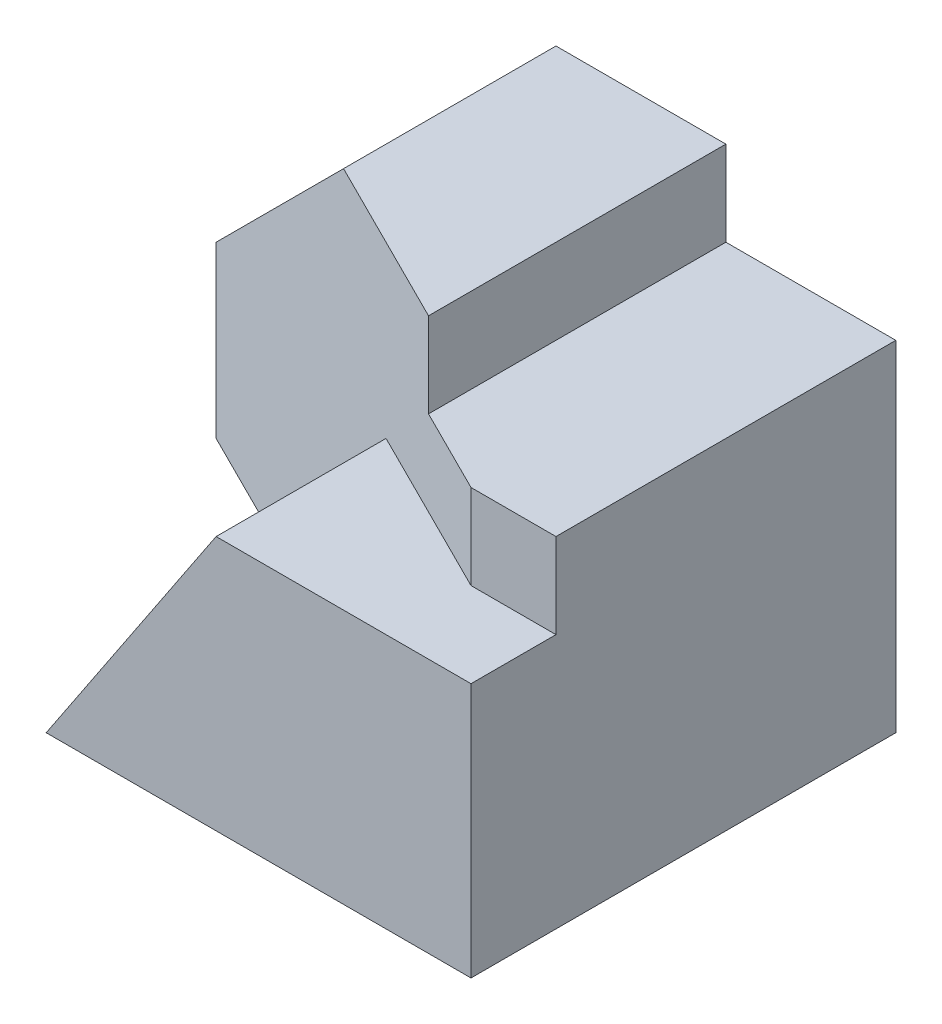
ISO-10303-21;
HEADER;
FILE_DESCRIPTION(('STEP AP214'),'2;1');
FILE_NAME('part.step','',(''),(''),'','','');
FILE_SCHEMA(('AUTOMOTIVE_DESIGN { 1 0 10303 214 1 1 1 1 }'));
ENDSEC;
DATA;
#1=APPLICATION_CONTEXT('core data for automotive mechanical design processes');
#2=APPLICATION_PROTOCOL_DEFINITION('international standard','automotive_design',2000,#1);
#3=PRODUCT_CONTEXT('',#1,'mechanical');
#4=PRODUCT('Part','Part','',(#3));
#5=PRODUCT_RELATED_PRODUCT_CATEGORY('part','',(#4));
#6=PRODUCT_DEFINITION_FORMATION('','',#4);
#7=PRODUCT_DEFINITION_CONTEXT('part definition',#1,'design');
#8=PRODUCT_DEFINITION('design','',#6,#7);
#9=PRODUCT_DEFINITION_SHAPE('','',#8);
#10=(LENGTH_UNIT() NAMED_UNIT(*) SI_UNIT(.MILLI.,.METRE.));
#11=(NAMED_UNIT(*) PLANE_ANGLE_UNIT() SI_UNIT($,.RADIAN.));
#12=(NAMED_UNIT(*) SI_UNIT($,.STERADIAN.) SOLID_ANGLE_UNIT());
#13=UNCERTAINTY_MEASURE_WITH_UNIT(LENGTH_MEASURE(1.E-05),#10,'distance_accuracy_value','');
#14=(GEOMETRIC_REPRESENTATION_CONTEXT(3) GLOBAL_UNCERTAINTY_ASSIGNED_CONTEXT((#13)) GLOBAL_UNIT_ASSIGNED_CONTEXT((#10,
#11,#12)) REPRESENTATION_CONTEXT('',''));
#15=CARTESIAN_POINT('',(0.,0.,0.));
#16=DIRECTION('',(0.,0.,1.));
#17=DIRECTION('',(1.,0.,0.));
#18=AXIS2_PLACEMENT_3D('',#15,#16,#17);
#19=CARTESIAN_POINT('',(0.,50.,50.));
#20=DIRECTION('',(0.,-1.,0.));
#21=DIRECTION('',(0.,0.,-1.));
#22=AXIS2_PLACEMENT_3D('',#19,#20,#21);
#23=PLANE('',#22);
#24=DIRECTION('',(0.,0.,1.));
#25=VECTOR('',#24,1.);
#26=CARTESIAN_POINT('',(30.,50.,0.));
#27=LINE('',#26,#25);
#28=CARTESIAN_POINT('',(30.,50.,0.));
#29=VERTEX_POINT('',#28);
#30=CARTESIAN_POINT('',(30.,50.,25.));
#31=VERTEX_POINT('',#30);
#32=EDGE_CURVE('E57',#29,#31,#27,.T.);
#33=ORIENTED_EDGE('',*,*,#32,.T.);
#34=DIRECTION('',(0.894427190999916,0.,0.447213595499958));
#35=VECTOR('',#34,1.);
#36=CARTESIAN_POINT('',(-4.,50.,8.00000000000001));
#37=LINE('',#36,#35);
#38=CARTESIAN_POINT('',(50.,50.,35.));
#39=VERTEX_POINT('',#38);
#40=EDGE_CURVE('E125',#31,#39,#37,.T.);
#41=ORIENTED_EDGE('',*,*,#40,.T.);
#42=DIRECTION('',(0.,0.,1.));
#43=VECTOR('',#42,1.);
#44=CARTESIAN_POINT('',(50.,50.,0.));
#45=LINE('',#44,#43);
#46=CARTESIAN_POINT('',(50.,50.,0.));
#47=VERTEX_POINT('',#46);
#48=EDGE_CURVE('E155',#47,#39,#45,.T.);
#49=ORIENTED_EDGE('',*,*,#48,.F.);
#50=DIRECTION('',(-1.,0.,0.));
#51=VECTOR('',#50,1.);
#52=CARTESIAN_POINT('',(0.,50.,0.));
#53=LINE('',#52,#51);
#54=EDGE_CURVE('E165',#47,#29,#53,.T.);
#55=ORIENTED_EDGE('',*,*,#54,.T.);
#56=EDGE_LOOP('',(#33,#41,#49,#55));
#57=FACE_BOUND('',#56,.T.);
#58=ADVANCED_FACE('F35',(#57),#23,.F.);
#59=CARTESIAN_POINT('',(50.,50.,0.));
#60=DIRECTION('',(-1.,0.,0.));
#61=DIRECTION('',(0.,-1.,0.));
#62=AXIS2_PLACEMENT_3D('',#59,#60,#61);
#63=PLANE('',#62);
#64=ORIENTED_EDGE('',*,*,#48,.T.);
#65=DIRECTION('',(0.,-1.,0.));
#66=VECTOR('',#65,1.);
#67=CARTESIAN_POINT('',(50.,50.,35.));
#68=LINE('',#67,#66);
#69=CARTESIAN_POINT('',(50.,40.,35.));
#70=VERTEX_POINT('',#69);
#71=EDGE_CURVE('E211',#39,#70,#68,.T.);
#72=ORIENTED_EDGE('',*,*,#71,.T.);
#73=DIRECTION('',(0.,0.,1.));
#74=VECTOR('',#73,1.);
#75=CARTESIAN_POINT('',(50.,40.,0.));
#76=LINE('',#75,#74);
#77=CARTESIAN_POINT('',(50.,40.,0.));
#78=VERTEX_POINT('',#77);
#79=EDGE_CURVE('E160',#78,#70,#76,.T.);
#80=ORIENTED_EDGE('',*,*,#79,.F.);
#81=DIRECTION('',(0.,-1.,0.));
#82=VECTOR('',#81,1.);
#83=CARTESIAN_POINT('',(50.,50.,0.));
#84=LINE('',#83,#82);
#85=EDGE_CURVE('E147',#47,#78,#84,.T.);
#86=ORIENTED_EDGE('',*,*,#85,.F.);
#87=EDGE_LOOP('',(#64,#72,#80,#86));
#88=FACE_BOUND('',#87,.T.);
#89=ADVANCED_FACE('F230',(#88),#63,.F.);
#90=CARTESIAN_POINT('',(0.,20.,0.));
#91=DIRECTION('',(0.707106781186547,-0.707106781186547,0.));
#92=DIRECTION('',(0.707106781186548,0.707106781186548,0.));
#93=AXIS2_PLACEMENT_3D('',#90,#91,#92);
#94=PLANE('',#93);
#95=DIRECTION('',(0.666666666666667,0.666666666666667,0.333333333333333));
#96=VECTOR('',#95,1.);
#97=CARTESIAN_POINT('',(-2.22222222222222,17.7777777777778,8.88888888888889));
#98=LINE('',#97,#96);
#99=CARTESIAN_POINT('',(0.,20.,10.));
#100=VERTEX_POINT('',#99);
#101=EDGE_CURVE('E11',#100,#31,#98,.T.);
#102=ORIENTED_EDGE('',*,*,#101,.T.);
#103=ORIENTED_EDGE('',*,*,#32,.F.);
#104=DIRECTION('',(0.707106781186547,0.707106781186547,0.));
#105=VECTOR('',#104,1.);
#106=CARTESIAN_POINT('',(0.,20.,0.));
#107=LINE('',#106,#105);
#108=CARTESIAN_POINT('',(0.,20.,0.));
#109=VERTEX_POINT('',#108);
#110=EDGE_CURVE('E140',#109,#29,#107,.T.);
#111=ORIENTED_EDGE('',*,*,#110,.F.);
#112=DIRECTION('',(0.,0.,1.));
#113=VECTOR('',#112,1.);
#114=CARTESIAN_POINT('',(0.,20.,0.));
#115=LINE('',#114,#113);
#116=EDGE_CURVE('E145',#109,#100,#115,.T.);
#117=ORIENTED_EDGE('',*,*,#116,.T.);
#118=EDGE_LOOP('',(#102,#103,#111,#117));
#119=FACE_BOUND('',#118,.T.);
#120=ADVANCED_FACE('F235',(#119),#94,.F.);
#121=CARTESIAN_POINT('',(0.,0.,50.));
#122=DIRECTION('',(1.,0.,0.));
#123=DIRECTION('',(0.,0.,-1.));
#124=AXIS2_PLACEMENT_3D('',#121,#122,#123);
#125=PLANE('',#124);
#126=DIRECTION('',(0.,0.,-1.));
#127=VECTOR('',#126,1.);
#128=CARTESIAN_POINT('',(0.,0.,50.));
#129=LINE('',#128,#127);
#130=CARTESIAN_POINT('',(0.,0.,10.));
#131=VERTEX_POINT('',#130);
#132=CARTESIAN_POINT('',(0.,0.,0.));
#133=VERTEX_POINT('',#132);
#134=EDGE_CURVE('E43',#131,#133,#129,.T.);
#135=ORIENTED_EDGE('',*,*,#134,.F.);
#136=DIRECTION('',(0.,-1.,0.));
#137=VECTOR('',#136,1.);
#138=CARTESIAN_POINT('',(0.,50.,10.));
#139=LINE('',#138,#137);
#140=EDGE_CURVE('E131',#100,#131,#139,.T.);
#141=ORIENTED_EDGE('',*,*,#140,.F.);
#142=ORIENTED_EDGE('',*,*,#116,.F.);
#143=DIRECTION('',(0.,-1.,0.));
#144=VECTOR('',#143,1.);
#145=CARTESIAN_POINT('',(0.,0.,0.));
#146=LINE('',#145,#144);
#147=EDGE_CURVE('E159',#109,#133,#146,.T.);
#148=ORIENTED_EDGE('',*,*,#147,.T.);
#149=EDGE_LOOP('',(#135,#141,#142,#148));
#150=FACE_BOUND('',#149,.T.);
#151=ADVANCED_FACE('F37',(#150),#125,.F.);
#152=CARTESIAN_POINT('',(0.,0.,50.));
#153=DIRECTION('',(0.,1.,0.));
#154=DIRECTION('',(0.,0.,1.));
#155=AXIS2_PLACEMENT_3D('',#152,#153,#154);
#156=PLANE('',#155);
#157=DIRECTION('',(0.,0.,1.));
#158=VECTOR('',#157,1.);
#159=CARTESIAN_POINT('',(20.,0.,20.));
#160=LINE('',#159,#158);
#161=CARTESIAN_POINT('',(20.,0.,20.));
#162=VERTEX_POINT('',#161);
#163=CARTESIAN_POINT('',(20.,0.,50.));
#164=VERTEX_POINT('',#163);
#165=EDGE_CURVE('E122',#162,#164,#160,.T.);
#166=ORIENTED_EDGE('',*,*,#165,.F.);
#167=DIRECTION('',(0.894427190999916,0.,0.447213595499958));
#168=VECTOR('',#167,1.);
#169=CARTESIAN_POINT('',(0.,0.,10.));
#170=LINE('',#169,#168);
#171=EDGE_CURVE('E128',#131,#162,#170,.T.);
#172=ORIENTED_EDGE('',*,*,#171,.F.);
#173=ORIENTED_EDGE('',*,*,#134,.T.);
#174=DIRECTION('',(1.,0.,0.));
#175=VECTOR('',#174,1.);
#176=CARTESIAN_POINT('',(0.,0.,0.));
#177=LINE('',#176,#175);
#178=CARTESIAN_POINT('',(70.,0.,0.));
#179=VERTEX_POINT('',#178);
#180=EDGE_CURVE('E171',#133,#179,#177,.T.);
#181=ORIENTED_EDGE('',*,*,#180,.T.);
#182=DIRECTION('',(0.,0.,-1.));
#183=VECTOR('',#182,1.);
#184=CARTESIAN_POINT('',(70.,0.,50.));
#185=LINE('',#184,#183);
#186=CARTESIAN_POINT('',(70.,0.,50.));
#187=VERTEX_POINT('',#186);
#188=EDGE_CURVE('E168',#187,#179,#185,.T.);
#189=ORIENTED_EDGE('',*,*,#188,.F.);
#190=DIRECTION('',(1.,0.,0.));
#191=VECTOR('',#190,1.);
#192=CARTESIAN_POINT('',(0.,0.,50.));
#193=LINE('',#192,#191);
#194=EDGE_CURVE('E138',#164,#187,#193,.T.);
#195=ORIENTED_EDGE('',*,*,#194,.F.);
#196=EDGE_LOOP('',(#166,#172,#173,#181,#189,#195));
#197=FACE_BOUND('',#196,.T.);
#198=ADVANCED_FACE('F136',(#197),#156,.F.);
#199=CARTESIAN_POINT('',(70.,0.,50.));
#200=DIRECTION('',(-1.,0.,0.));
#201=DIRECTION('',(0.,0.,1.));
#202=AXIS2_PLACEMENT_3D('',#199,#200,#201);
#203=PLANE('',#202);
#204=DIRECTION('',(0.,1.,0.));
#205=VECTOR('',#204,1.);
#206=CARTESIAN_POINT('',(70.,30.,40.));
#207=LINE('',#206,#205);
#208=CARTESIAN_POINT('',(70.,30.,40.));
#209=VERTEX_POINT('',#208);
#210=CARTESIAN_POINT('',(70.,40.,40.));
#211=VERTEX_POINT('',#210);
#212=EDGE_CURVE('E217',#209,#211,#207,.T.);
#213=ORIENTED_EDGE('',*,*,#212,.F.);
#214=DIRECTION('',(0.,0.,1.));
#215=VECTOR('',#214,1.);
#216=CARTESIAN_POINT('',(70.,30.,40.));
#217=LINE('',#216,#215);
#218=CARTESIAN_POINT('',(70.,30.,50.));
#219=VERTEX_POINT('',#218);
#220=EDGE_CURVE('E191',#209,#219,#217,.T.);
#221=ORIENTED_EDGE('',*,*,#220,.T.);
#222=DIRECTION('',(0.,1.,0.));
#223=VECTOR('',#222,1.);
#224=CARTESIAN_POINT('',(70.,0.,50.));
#225=LINE('',#224,#223);
#226=EDGE_CURVE('E164',#187,#219,#225,.T.);
#227=ORIENTED_EDGE('',*,*,#226,.F.);
#228=ORIENTED_EDGE('',*,*,#188,.T.);
#229=DIRECTION('',(0.,1.,0.));
#230=VECTOR('',#229,1.);
#231=CARTESIAN_POINT('',(70.,0.,0.));
#232=LINE('',#231,#230);
#233=CARTESIAN_POINT('',(70.,40.,0.));
#234=VERTEX_POINT('',#233);
#235=EDGE_CURVE('E173',#179,#234,#232,.T.);
#236=ORIENTED_EDGE('',*,*,#235,.T.);
#237=DIRECTION('',(0.,0.,1.));
#238=VECTOR('',#237,1.);
#239=CARTESIAN_POINT('',(70.,40.,0.));
#240=LINE('',#239,#238);
#241=EDGE_CURVE('E156',#234,#211,#240,.T.);
#242=ORIENTED_EDGE('',*,*,#241,.T.);
#243=EDGE_LOOP('',(#213,#221,#227,#228,#236,#242));
#244=FACE_BOUND('',#243,.T.);
#245=ADVANCED_FACE('F188',(#244),#203,.F.);
#246=CARTESIAN_POINT('',(0.,0.,50.));
#247=DIRECTION('',(0.,0.,-1.));
#248=DIRECTION('',(-1.,0.,0.));
#249=AXIS2_PLACEMENT_3D('',#246,#247,#248);
#250=PLANE('',#249);
#251=ORIENTED_EDGE('',*,*,#226,.T.);
#252=DIRECTION('',(1.,0.,0.));
#253=VECTOR('',#252,1.);
#254=CARTESIAN_POINT('',(40.,30.,50.));
#255=LINE('',#254,#253);
#256=CARTESIAN_POINT('',(40.,30.,50.));
#257=VERTEX_POINT('',#256);
#258=EDGE_CURVE('E195',#257,#219,#255,.T.);
#259=ORIENTED_EDGE('',*,*,#258,.F.);
#260=DIRECTION('',(0.554700196225229,0.832050294337844,0.));
#261=VECTOR('',#260,1.);
#262=CARTESIAN_POINT('',(20.,0.,50.));
#263=LINE('',#262,#261);
#264=EDGE_CURVE('E196',#164,#257,#263,.T.);
#265=ORIENTED_EDGE('',*,*,#264,.F.);
#266=ORIENTED_EDGE('',*,*,#194,.T.);
#267=EDGE_LOOP('',(#251,#259,#265,#266));
#268=FACE_BOUND('',#267,.T.);
#269=ADVANCED_FACE('F194',(#268),#250,.F.);
#270=CARTESIAN_POINT('',(0.,0.,0.));
#271=DIRECTION('',(0.,0.,-1.));
#272=DIRECTION('',(-1.,0.,0.));
#273=AXIS2_PLACEMENT_3D('',#270,#271,#272);
#274=PLANE('',#273);
#275=ORIENTED_EDGE('',*,*,#110,.T.);
#276=ORIENTED_EDGE('',*,*,#54,.F.);
#277=ORIENTED_EDGE('',*,*,#85,.T.);
#278=DIRECTION('',(1.,0.,0.));
#279=VECTOR('',#278,1.);
#280=CARTESIAN_POINT('',(70.,40.,0.));
#281=LINE('',#280,#279);
#282=EDGE_CURVE('E152',#78,#234,#281,.T.);
#283=ORIENTED_EDGE('',*,*,#282,.T.);
#284=ORIENTED_EDGE('',*,*,#235,.F.);
#285=ORIENTED_EDGE('',*,*,#180,.F.);
#286=ORIENTED_EDGE('',*,*,#147,.F.);
#287=EDGE_LOOP('',(#275,#276,#277,#283,#284,#285,#286));
#288=FACE_BOUND('',#287,.T.);
#289=ADVANCED_FACE('F185',(#288),#274,.T.);
#290=CARTESIAN_POINT('',(70.,40.,0.));
#291=DIRECTION('',(0.,-1.,0.));
#292=DIRECTION('',(0.,0.,-1.));
#293=AXIS2_PLACEMENT_3D('',#290,#291,#292);
#294=PLANE('',#293);
#295=ORIENTED_EDGE('',*,*,#79,.T.);
#296=DIRECTION('',(0.894427190999916,0.,0.447213595499958));
#297=VECTOR('',#296,1.);
#298=CARTESIAN_POINT('',(60.,40.,40.));
#299=LINE('',#298,#297);
#300=CARTESIAN_POINT('',(60.,40.,40.));
#301=VERTEX_POINT('',#300);
#302=EDGE_CURVE('E208',#70,#301,#299,.T.);
#303=ORIENTED_EDGE('',*,*,#302,.T.);
#304=DIRECTION('',(-1.,0.,0.));
#305=VECTOR('',#304,1.);
#306=CARTESIAN_POINT('',(60.,40.,40.));
#307=LINE('',#306,#305);
#308=EDGE_CURVE('E199',#211,#301,#307,.T.);
#309=ORIENTED_EDGE('',*,*,#308,.F.);
#310=ORIENTED_EDGE('',*,*,#241,.F.);
#311=ORIENTED_EDGE('',*,*,#282,.F.);
#312=EDGE_LOOP('',(#295,#303,#309,#310,#311));
#313=FACE_BOUND('',#312,.T.);
#314=ADVANCED_FACE('F223',(#313),#294,.F.);
#315=CARTESIAN_POINT('',(0.,50.,10.));
#316=DIRECTION('',(0.447213595499958,0.,-0.894427190999916));
#317=DIRECTION('',(-0.894427190999916,0.,-0.447213595499958));
#318=AXIS2_PLACEMENT_3D('',#315,#316,#317);
#319=PLANE('',#318);
#320=ORIENTED_EDGE('',*,*,#171,.T.);
#321=DIRECTION('',(0.534522483824849,0.801783725737273,0.267261241912424));
#322=VECTOR('',#321,1.);
#323=CARTESIAN_POINT('',(40.,30.,30.));
#324=LINE('',#323,#322);
#325=CARTESIAN_POINT('',(40.,30.,30.));
#326=VERTEX_POINT('',#325);
#327=EDGE_CURVE('E117',#162,#326,#324,.T.);
#328=ORIENTED_EDGE('',*,*,#327,.T.);
#329=DIRECTION('',(0.894427190999916,0.,0.447213595499958));
#330=VECTOR('',#329,1.);
#331=CARTESIAN_POINT('',(60.,30.,40.));
#332=LINE('',#331,#330);
#333=CARTESIAN_POINT('',(60.,30.,40.));
#334=VERTEX_POINT('',#333);
#335=EDGE_CURVE('E50',#326,#334,#332,.T.);
#336=ORIENTED_EDGE('',*,*,#335,.T.);
#337=DIRECTION('',(0.,-1.,0.));
#338=VECTOR('',#337,1.);
#339=CARTESIAN_POINT('',(60.,30.,40.));
#340=LINE('',#339,#338);
#341=EDGE_CURVE('E207',#301,#334,#340,.T.);
#342=ORIENTED_EDGE('',*,*,#341,.F.);
#343=ORIENTED_EDGE('',*,*,#302,.F.);
#344=ORIENTED_EDGE('',*,*,#71,.F.);
#345=ORIENTED_EDGE('',*,*,#40,.F.);
#346=ORIENTED_EDGE('',*,*,#101,.F.);
#347=ORIENTED_EDGE('',*,*,#140,.T.);
#348=EDGE_LOOP('',(#320,#328,#336,#342,#343,#344,#345,#346,#347));
#349=FACE_BOUND('',#348,.T.);
#350=ADVANCED_FACE('F129',(#349),#319,.F.);
#351=CARTESIAN_POINT('',(40.,30.,20.));
#352=DIRECTION('',(0.,-1.,0.));
#353=DIRECTION('',(0.,0.,-1.));
#354=AXIS2_PLACEMENT_3D('',#351,#352,#353);
#355=PLANE('',#354);
#356=DIRECTION('',(1.,0.,0.));
#357=VECTOR('',#356,1.);
#358=CARTESIAN_POINT('',(60.,30.,40.));
#359=LINE('',#358,#357);
#360=EDGE_CURVE('E206',#334,#209,#359,.T.);
#361=ORIENTED_EDGE('',*,*,#360,.F.);
#362=ORIENTED_EDGE('',*,*,#335,.F.);
#363=DIRECTION('',(0.,0.,1.));
#364=VECTOR('',#363,1.);
#365=CARTESIAN_POINT('',(40.,30.,20.));
#366=LINE('',#365,#364);
#367=EDGE_CURVE('E124',#326,#257,#366,.T.);
#368=ORIENTED_EDGE('',*,*,#367,.T.);
#369=ORIENTED_EDGE('',*,*,#258,.T.);
#370=ORIENTED_EDGE('',*,*,#220,.F.);
#371=EDGE_LOOP('',(#361,#362,#368,#369,#370));
#372=FACE_BOUND('',#371,.T.);
#373=ADVANCED_FACE('F204',(#372),#355,.F.);
#374=CARTESIAN_POINT('',(20.,0.,20.));
#375=DIRECTION('',(0.832050294337844,-0.554700196225229,0.));
#376=DIRECTION('',(0.554700196225229,0.832050294337844,0.));
#377=AXIS2_PLACEMENT_3D('',#374,#375,#376);
#378=PLANE('',#377);
#379=ORIENTED_EDGE('',*,*,#367,.F.);
#380=ORIENTED_EDGE('',*,*,#327,.F.);
#381=ORIENTED_EDGE('',*,*,#165,.T.);
#382=ORIENTED_EDGE('',*,*,#264,.T.);
#383=EDGE_LOOP('',(#379,#380,#381,#382));
#384=FACE_BOUND('',#383,.T.);
#385=ADVANCED_FACE('F119',(#384),#378,.F.);
#386=CARTESIAN_POINT('',(0.,0.,40.));
#387=DIRECTION('',(0.,0.,-1.));
#388=DIRECTION('',(-1.,0.,0.));
#389=AXIS2_PLACEMENT_3D('',#386,#387,#388);
#390=PLANE('',#389);
#391=ORIENTED_EDGE('',*,*,#341,.T.);
#392=ORIENTED_EDGE('',*,*,#360,.T.);
#393=ORIENTED_EDGE('',*,*,#212,.T.);
#394=ORIENTED_EDGE('',*,*,#308,.T.);
#395=EDGE_LOOP('',(#391,#392,#393,#394));
#396=FACE_BOUND('',#395,.T.);
#397=ADVANCED_FACE('F221',(#396),#390,.F.);
#398=CLOSED_SHELL('',(#58,#89,#120,#151,#198,#245,#269,#289,#314,#350,#373,#385,#397));
#399=MANIFOLD_SOLID_BREP('B2',#398);
#400=ADVANCED_BREP_SHAPE_REPRESENTATION('',(#18,#399),#14);
#401=SHAPE_DEFINITION_REPRESENTATION(#9,#400);
ENDSEC;
END-ISO-10303-21;
